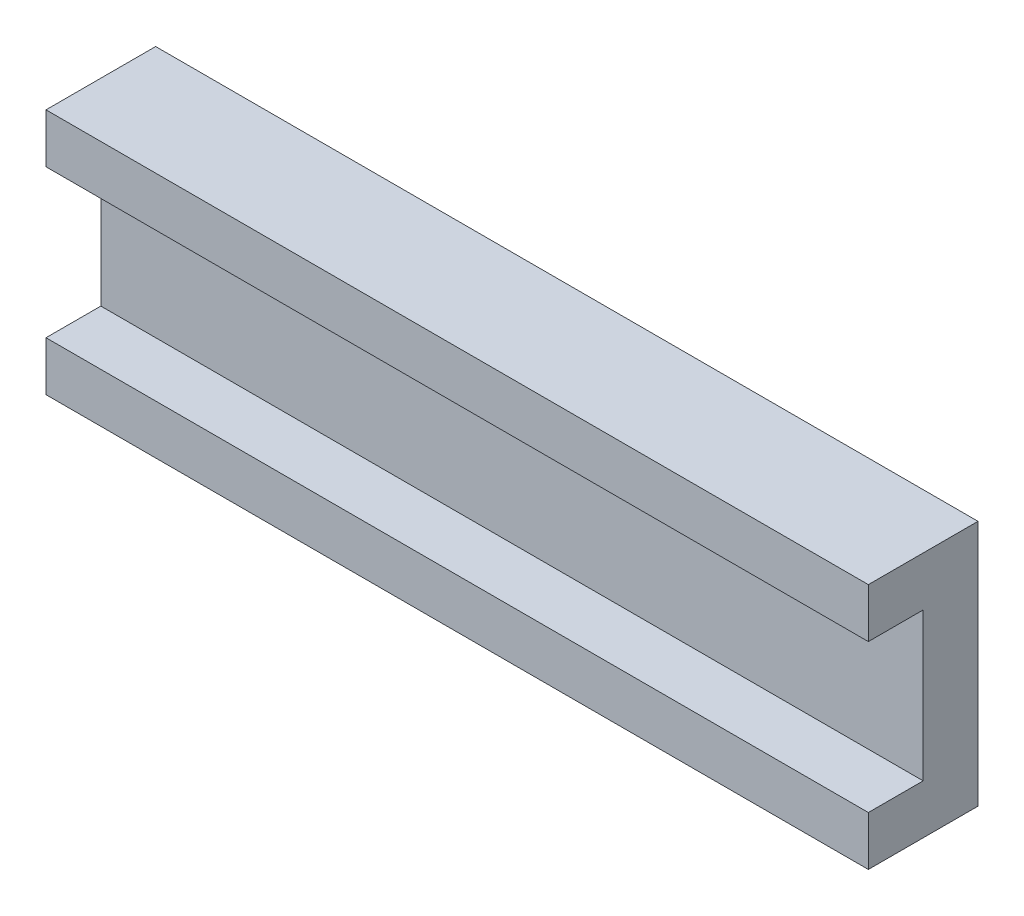
ISO-10303-21;
HEADER;
FILE_DESCRIPTION(('STEP AP214'),'2;1');
FILE_NAME('part.step','',(''),(''),'','','');
FILE_SCHEMA(('AUTOMOTIVE_DESIGN { 1 0 10303 214 1 1 1 1 }'));
ENDSEC;
DATA;
#1=APPLICATION_CONTEXT('core data for automotive mechanical design processes');
#2=APPLICATION_PROTOCOL_DEFINITION('international standard','automotive_design',2000,#1);
#3=PRODUCT_CONTEXT('',#1,'mechanical');
#4=PRODUCT('Part','Part','',(#3));
#5=PRODUCT_RELATED_PRODUCT_CATEGORY('part','',(#4));
#6=PRODUCT_DEFINITION_FORMATION('','',#4);
#7=PRODUCT_DEFINITION_CONTEXT('part definition',#1,'design');
#8=PRODUCT_DEFINITION('design','',#6,#7);
#9=PRODUCT_DEFINITION_SHAPE('','',#8);
#10=(LENGTH_UNIT() NAMED_UNIT(*) SI_UNIT(.MILLI.,.METRE.));
#11=(NAMED_UNIT(*) PLANE_ANGLE_UNIT() SI_UNIT($,.RADIAN.));
#12=(NAMED_UNIT(*) SI_UNIT($,.STERADIAN.) SOLID_ANGLE_UNIT());
#13=UNCERTAINTY_MEASURE_WITH_UNIT(LENGTH_MEASURE(1.E-05),#10,'distance_accuracy_value','');
#14=(GEOMETRIC_REPRESENTATION_CONTEXT(3) GLOBAL_UNCERTAINTY_ASSIGNED_CONTEXT((#13)) GLOBAL_UNIT_ASSIGNED_CONTEXT((#10,
#11,#12)) REPRESENTATION_CONTEXT('',''));
#15=CARTESIAN_POINT('',(0.,0.,0.));
#16=DIRECTION('',(0.,0.,1.));
#17=DIRECTION('',(1.,0.,0.));
#18=AXIS2_PLACEMENT_3D('',#15,#16,#17);
#19=CARTESIAN_POINT('',(0.,0.,20.));
#20=DIRECTION('',(0.,0.,-1.));
#21=DIRECTION('',(-1.,0.,0.));
#22=AXIS2_PLACEMENT_3D('',#19,#20,#21);
#23=PLANE('',#22);
#24=DIRECTION('',(0.,1.,0.));
#25=VECTOR('',#24,1.);
#26=CARTESIAN_POINT('',(0.,45.,20.));
#27=LINE('',#26,#25);
#28=CARTESIAN_POINT('',(0.,0.,20.));
#29=VERTEX_POINT('',#28);
#30=CARTESIAN_POINT('',(0.,8.99999999999999,20.));
#31=VERTEX_POINT('',#30);
#32=EDGE_CURVE('E133',#29,#31,#27,.T.);
#33=ORIENTED_EDGE('',*,*,#32,.T.);
#34=DIRECTION('',(1.,0.,0.));
#35=VECTOR('',#34,1.);
#36=CARTESIAN_POINT('',(-150.,8.99999999999999,20.));
#37=LINE('',#36,#35);
#38=CARTESIAN_POINT('',(-150.,8.99999999999999,20.));
#39=VERTEX_POINT('',#38);
#40=EDGE_CURVE('E124',#39,#31,#37,.T.);
#41=ORIENTED_EDGE('',*,*,#40,.F.);
#42=DIRECTION('',(0.,-1.,0.));
#43=VECTOR('',#42,1.);
#44=CARTESIAN_POINT('',(-150.,0.,20.));
#45=LINE('',#44,#43);
#46=CARTESIAN_POINT('',(-150.,0.,20.));
#47=VERTEX_POINT('',#46);
#48=EDGE_CURVE('E137',#39,#47,#45,.T.);
#49=ORIENTED_EDGE('',*,*,#48,.T.);
#50=DIRECTION('',(1.,0.,0.));
#51=VECTOR('',#50,1.);
#52=CARTESIAN_POINT('',(0.,0.,20.));
#53=LINE('',#52,#51);
#54=EDGE_CURVE('E58',#47,#29,#53,.T.);
#55=ORIENTED_EDGE('',*,*,#54,.T.);
#56=EDGE_LOOP('',(#33,#41,#49,#55));
#57=FACE_BOUND('',#56,.T.);
#58=ADVANCED_FACE('F34',(#57),#23,.F.);
#59=CARTESIAN_POINT('',(0.,45.,20.));
#60=DIRECTION('',(-1.,0.,0.));
#61=DIRECTION('',(0.,0.,1.));
#62=AXIS2_PLACEMENT_3D('',#59,#60,#61);
#63=PLANE('',#62);
#64=DIRECTION('',(0.,1.,0.));
#65=VECTOR('',#64,1.);
#66=CARTESIAN_POINT('',(0.,8.99999999999999,10.));
#67=LINE('',#66,#65);
#68=CARTESIAN_POINT('',(0.,8.99999999999999,10.));
#69=VERTEX_POINT('',#68);
#70=CARTESIAN_POINT('',(0.,36.,10.));
#71=VERTEX_POINT('',#70);
#72=EDGE_CURVE('E115',#69,#71,#67,.T.);
#73=ORIENTED_EDGE('',*,*,#72,.F.);
#74=DIRECTION('',(0.,0.,1.));
#75=VECTOR('',#74,1.);
#76=CARTESIAN_POINT('',(0.,8.99999999999999,10.));
#77=LINE('',#76,#75);
#78=EDGE_CURVE('E147',#69,#31,#77,.T.);
#79=ORIENTED_EDGE('',*,*,#78,.T.);
#80=ORIENTED_EDGE('',*,*,#32,.F.);
#81=DIRECTION('',(0.,0.,-1.));
#82=VECTOR('',#81,1.);
#83=CARTESIAN_POINT('',(0.,0.,20.));
#84=LINE('',#83,#82);
#85=CARTESIAN_POINT('',(0.,0.,0.));
#86=VERTEX_POINT('',#85);
#87=EDGE_CURVE('E142',#29,#86,#84,.T.);
#88=ORIENTED_EDGE('',*,*,#87,.T.);
#89=DIRECTION('',(0.,1.,0.));
#90=VECTOR('',#89,1.);
#91=CARTESIAN_POINT('',(0.,45.,0.));
#92=LINE('',#91,#90);
#93=CARTESIAN_POINT('',(0.,45.,0.));
#94=VERTEX_POINT('',#93);
#95=EDGE_CURVE('E143',#86,#94,#92,.T.);
#96=ORIENTED_EDGE('',*,*,#95,.T.);
#97=DIRECTION('',(0.,0.,-1.));
#98=VECTOR('',#97,1.);
#99=CARTESIAN_POINT('',(0.,45.,20.));
#100=LINE('',#99,#98);
#101=CARTESIAN_POINT('',(0.,45.,20.));
#102=VERTEX_POINT('',#101);
#103=EDGE_CURVE('E11',#102,#94,#100,.T.);
#104=ORIENTED_EDGE('',*,*,#103,.F.);
#105=CARTESIAN_POINT('',(0.,36.,20.));
#106=VERTEX_POINT('',#105);
#107=EDGE_CURVE('E86',#106,#102,#27,.T.);
#108=ORIENTED_EDGE('',*,*,#107,.F.);
#109=DIRECTION('',(0.,0.,1.));
#110=VECTOR('',#109,1.);
#111=CARTESIAN_POINT('',(0.,36.,10.));
#112=LINE('',#111,#110);
#113=EDGE_CURVE('E49',#71,#106,#112,.T.);
#114=ORIENTED_EDGE('',*,*,#113,.F.);
#115=EDGE_LOOP('',(#73,#79,#80,#88,#96,#104,#108,#114));
#116=FACE_BOUND('',#115,.T.);
#117=ADVANCED_FACE('F36',(#116),#63,.F.);
#118=CARTESIAN_POINT('',(-150.,45.,20.));
#119=DIRECTION('',(0.,-1.,0.));
#120=DIRECTION('',(0.,0.,-1.));
#121=AXIS2_PLACEMENT_3D('',#118,#119,#120);
#122=PLANE('',#121);
#123=DIRECTION('',(-1.,0.,0.));
#124=VECTOR('',#123,1.);
#125=CARTESIAN_POINT('',(-150.,45.,0.));
#126=LINE('',#125,#124);
#127=CARTESIAN_POINT('',(-150.,45.,0.));
#128=VERTEX_POINT('',#127);
#129=EDGE_CURVE('E146',#94,#128,#126,.T.);
#130=ORIENTED_EDGE('',*,*,#129,.T.);
#131=DIRECTION('',(0.,0.,-1.));
#132=VECTOR('',#131,1.);
#133=CARTESIAN_POINT('',(-150.,45.,20.));
#134=LINE('',#133,#132);
#135=CARTESIAN_POINT('',(-150.,45.,20.));
#136=VERTEX_POINT('',#135);
#137=EDGE_CURVE('E42',#136,#128,#134,.T.);
#138=ORIENTED_EDGE('',*,*,#137,.F.);
#139=DIRECTION('',(-1.,0.,0.));
#140=VECTOR('',#139,1.);
#141=CARTESIAN_POINT('',(-150.,45.,20.));
#142=LINE('',#141,#140);
#143=EDGE_CURVE('E135',#102,#136,#142,.T.);
#144=ORIENTED_EDGE('',*,*,#143,.F.);
#145=ORIENTED_EDGE('',*,*,#103,.T.);
#146=EDGE_LOOP('',(#130,#138,#144,#145));
#147=FACE_BOUND('',#146,.T.);
#148=ADVANCED_FACE('F191',(#147),#122,.F.);
#149=CARTESIAN_POINT('',(-150.,0.,20.));
#150=DIRECTION('',(1.,0.,0.));
#151=DIRECTION('',(0.,0.,-1.));
#152=AXIS2_PLACEMENT_3D('',#149,#150,#151);
#153=PLANE('',#152);
#154=ORIENTED_EDGE('',*,*,#48,.F.);
#155=DIRECTION('',(0.,0.,1.));
#156=VECTOR('',#155,1.);
#157=CARTESIAN_POINT('',(-150.,8.99999999999999,10.));
#158=LINE('',#157,#156);
#159=CARTESIAN_POINT('',(-150.,8.99999999999999,10.));
#160=VERTEX_POINT('',#159);
#161=EDGE_CURVE('E128',#160,#39,#158,.T.);
#162=ORIENTED_EDGE('',*,*,#161,.F.);
#163=DIRECTION('',(0.,-1.,0.));
#164=VECTOR('',#163,1.);
#165=CARTESIAN_POINT('',(-150.,35.9999999999999,10.));
#166=LINE('',#165,#164);
#167=CARTESIAN_POINT('',(-150.,35.9999999999999,10.));
#168=VERTEX_POINT('',#167);
#169=EDGE_CURVE('E114',#168,#160,#166,.T.);
#170=ORIENTED_EDGE('',*,*,#169,.F.);
#171=DIRECTION('',(0.,0.,1.));
#172=VECTOR('',#171,1.);
#173=CARTESIAN_POINT('',(-150.,35.9999999999999,10.));
#174=LINE('',#173,#172);
#175=CARTESIAN_POINT('',(-150.,35.9999999999999,20.));
#176=VERTEX_POINT('',#175);
#177=EDGE_CURVE('E111',#168,#176,#174,.T.);
#178=ORIENTED_EDGE('',*,*,#177,.T.);
#179=EDGE_CURVE('E138',#136,#176,#45,.T.);
#180=ORIENTED_EDGE('',*,*,#179,.F.);
#181=ORIENTED_EDGE('',*,*,#137,.T.);
#182=DIRECTION('',(0.,-1.,0.));
#183=VECTOR('',#182,1.);
#184=CARTESIAN_POINT('',(-150.,0.,0.));
#185=LINE('',#184,#183);
#186=CARTESIAN_POINT('',(-150.,0.,0.));
#187=VERTEX_POINT('',#186);
#188=EDGE_CURVE('E149',#128,#187,#185,.T.);
#189=ORIENTED_EDGE('',*,*,#188,.T.);
#190=DIRECTION('',(0.,0.,-1.));
#191=VECTOR('',#190,1.);
#192=CARTESIAN_POINT('',(-150.,0.,20.));
#193=LINE('',#192,#191);
#194=EDGE_CURVE('E153',#47,#187,#193,.T.);
#195=ORIENTED_EDGE('',*,*,#194,.F.);
#196=EDGE_LOOP('',(#154,#162,#170,#178,#180,#181,#189,#195));
#197=FACE_BOUND('',#196,.T.);
#198=ADVANCED_FACE('F160',(#197),#153,.F.);
#199=CARTESIAN_POINT('',(0.,0.,20.));
#200=DIRECTION('',(0.,1.,0.));
#201=DIRECTION('',(0.,0.,1.));
#202=AXIS2_PLACEMENT_3D('',#199,#200,#201);
#203=PLANE('',#202);
#204=DIRECTION('',(1.,0.,0.));
#205=VECTOR('',#204,1.);
#206=CARTESIAN_POINT('',(0.,0.,0.));
#207=LINE('',#206,#205);
#208=EDGE_CURVE('E79',#187,#86,#207,.T.);
#209=ORIENTED_EDGE('',*,*,#208,.T.);
#210=ORIENTED_EDGE('',*,*,#87,.F.);
#211=ORIENTED_EDGE('',*,*,#54,.F.);
#212=ORIENTED_EDGE('',*,*,#194,.T.);
#213=EDGE_LOOP('',(#209,#210,#211,#212));
#214=FACE_BOUND('',#213,.T.);
#215=ADVANCED_FACE('F167',(#214),#203,.F.);
#216=ORIENTED_EDGE('',*,*,#179,.T.);
#217=DIRECTION('',(-1.,0.,0.));
#218=VECTOR('',#217,1.);
#219=CARTESIAN_POINT('',(0.,36.,20.));
#220=LINE('',#219,#218);
#221=EDGE_CURVE('E171',#106,#176,#220,.T.);
#222=ORIENTED_EDGE('',*,*,#221,.F.);
#223=ORIENTED_EDGE('',*,*,#107,.T.);
#224=ORIENTED_EDGE('',*,*,#143,.T.);
#225=EDGE_LOOP('',(#216,#222,#223,#224));
#226=FACE_BOUND('',#225,.T.);
#227=ADVANCED_FACE('F183',(#226),#23,.F.);
#228=CARTESIAN_POINT('',(0.,0.,0.));
#229=DIRECTION('',(0.,0.,-1.));
#230=DIRECTION('',(-1.,0.,0.));
#231=AXIS2_PLACEMENT_3D('',#228,#229,#230);
#232=PLANE('',#231);
#233=ORIENTED_EDGE('',*,*,#95,.F.);
#234=ORIENTED_EDGE('',*,*,#208,.F.);
#235=ORIENTED_EDGE('',*,*,#188,.F.);
#236=ORIENTED_EDGE('',*,*,#129,.F.);
#237=EDGE_LOOP('',(#233,#234,#235,#236));
#238=FACE_BOUND('',#237,.T.);
#239=ADVANCED_FACE('F165',(#238),#232,.T.);
#240=CARTESIAN_POINT('',(-150.,8.99999999999999,10.));
#241=DIRECTION('',(0.,-1.,0.));
#242=DIRECTION('',(1.,0.,0.));
#243=AXIS2_PLACEMENT_3D('',#240,#241,#242);
#244=PLANE('',#243);
#245=ORIENTED_EDGE('',*,*,#40,.T.);
#246=ORIENTED_EDGE('',*,*,#78,.F.);
#247=DIRECTION('',(1.,0.,0.));
#248=VECTOR('',#247,1.);
#249=CARTESIAN_POINT('',(-150.,8.99999999999999,10.));
#250=LINE('',#249,#248);
#251=EDGE_CURVE('E121',#160,#69,#250,.T.);
#252=ORIENTED_EDGE('',*,*,#251,.F.);
#253=ORIENTED_EDGE('',*,*,#161,.T.);
#254=EDGE_LOOP('',(#245,#246,#252,#253));
#255=FACE_BOUND('',#254,.T.);
#256=ADVANCED_FACE('F175',(#255),#244,.F.);
#257=CARTESIAN_POINT('',(0.,36.,10.));
#258=DIRECTION('',(0.,1.,0.));
#259=DIRECTION('',(-1.,0.,0.));
#260=AXIS2_PLACEMENT_3D('',#257,#258,#259);
#261=PLANE('',#260);
#262=ORIENTED_EDGE('',*,*,#221,.T.);
#263=ORIENTED_EDGE('',*,*,#177,.F.);
#264=DIRECTION('',(-1.,0.,0.));
#265=VECTOR('',#264,1.);
#266=CARTESIAN_POINT('',(0.,36.,10.));
#267=LINE('',#266,#265);
#268=EDGE_CURVE('E107',#71,#168,#267,.T.);
#269=ORIENTED_EDGE('',*,*,#268,.F.);
#270=ORIENTED_EDGE('',*,*,#113,.T.);
#271=EDGE_LOOP('',(#262,#263,#269,#270));
#272=FACE_BOUND('',#271,.T.);
#273=ADVANCED_FACE('F109',(#272),#261,.F.);
#274=CARTESIAN_POINT('',(0.,0.,10.));
#275=DIRECTION('',(0.,0.,1.));
#276=DIRECTION('',(1.,0.,0.));
#277=AXIS2_PLACEMENT_3D('',#274,#275,#276);
#278=PLANE('',#277);
#279=ORIENTED_EDGE('',*,*,#72,.T.);
#280=ORIENTED_EDGE('',*,*,#268,.T.);
#281=ORIENTED_EDGE('',*,*,#169,.T.);
#282=ORIENTED_EDGE('',*,*,#251,.T.);
#283=EDGE_LOOP('',(#279,#280,#281,#282));
#284=FACE_BOUND('',#283,.T.);
#285=ADVANCED_FACE('F119',(#284),#278,.T.);
#286=CLOSED_SHELL('',(#58,#117,#148,#198,#215,#227,#239,#256,#273,#285));
#287=MANIFOLD_SOLID_BREP('B2',#286);
#288=ADVANCED_BREP_SHAPE_REPRESENTATION('',(#18,#287),#14);
#289=SHAPE_DEFINITION_REPRESENTATION(#9,#288);
ENDSEC;
END-ISO-10303-21;
